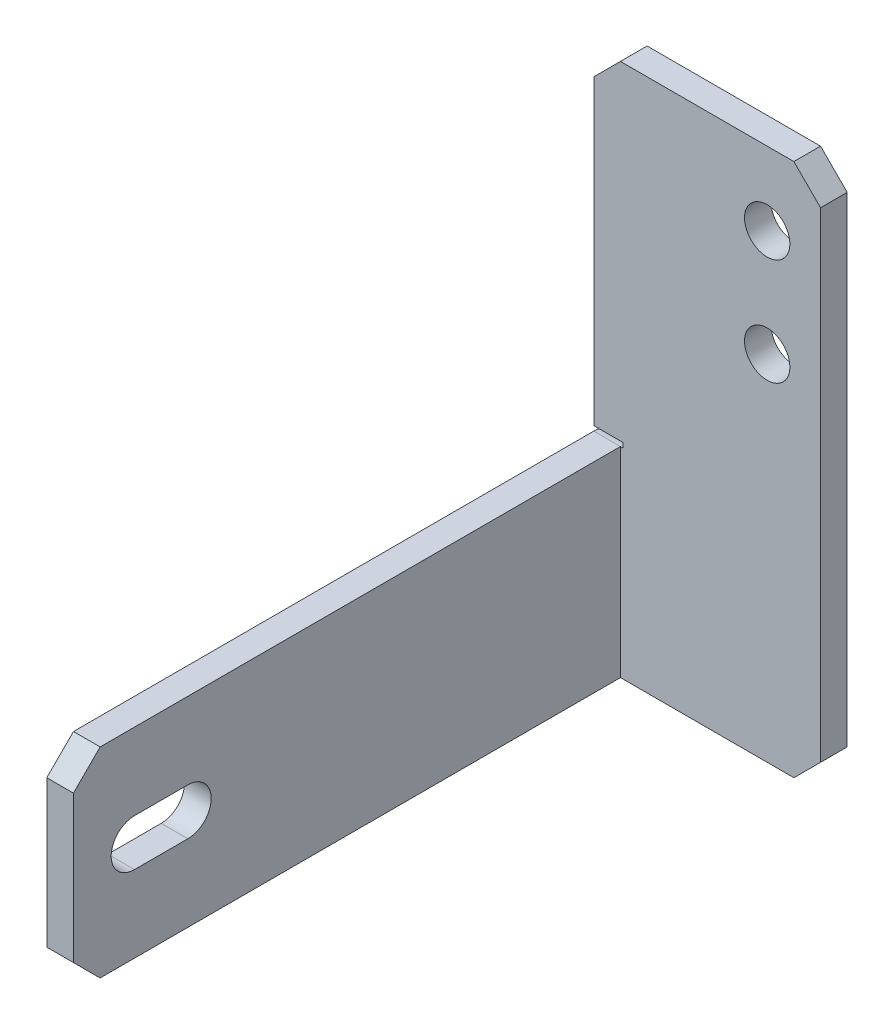
ISO-10303-21;
HEADER;
FILE_DESCRIPTION(('STEP AP214'),'2;1');
FILE_NAME('part.step','',(''),(''),'','','');
FILE_SCHEMA(('AUTOMOTIVE_DESIGN { 1 0 10303 214 1 1 1 1 }'));
ENDSEC;
DATA;
#1=APPLICATION_CONTEXT('core data for automotive mechanical design processes');
#2=APPLICATION_PROTOCOL_DEFINITION('international standard','automotive_design',2000,#1);
#3=PRODUCT_CONTEXT('',#1,'mechanical');
#4=PRODUCT('Part','Part','',(#3));
#5=PRODUCT_RELATED_PRODUCT_CATEGORY('part','',(#4));
#6=PRODUCT_DEFINITION_FORMATION('','',#4);
#7=PRODUCT_DEFINITION_CONTEXT('part definition',#1,'design');
#8=PRODUCT_DEFINITION('design','',#6,#7);
#9=PRODUCT_DEFINITION_SHAPE('','',#8);
#10=(LENGTH_UNIT() NAMED_UNIT(*) SI_UNIT(.MILLI.,.METRE.));
#11=(NAMED_UNIT(*) PLANE_ANGLE_UNIT() SI_UNIT($,.RADIAN.));
#12=(NAMED_UNIT(*) SI_UNIT($,.STERADIAN.) SOLID_ANGLE_UNIT());
#13=UNCERTAINTY_MEASURE_WITH_UNIT(LENGTH_MEASURE(1.E-05),#10,'distance_accuracy_value','');
#14=(GEOMETRIC_REPRESENTATION_CONTEXT(3) GLOBAL_UNCERTAINTY_ASSIGNED_CONTEXT((#13)) GLOBAL_UNIT_ASSIGNED_CONTEXT((#10,
#11,#12)) REPRESENTATION_CONTEXT('',''));
#15=CARTESIAN_POINT('',(0.,0.,0.));
#16=DIRECTION('',(0.,0.,1.));
#17=DIRECTION('',(1.,0.,0.));
#18=AXIS2_PLACEMENT_3D('',#15,#16,#17);
#19=CARTESIAN_POINT('',(0.,0.,2.));
#20=DIRECTION('',(0.,0.,1.));
#21=DIRECTION('',(1.,0.,0.));
#22=AXIS2_PLACEMENT_3D('',#19,#20,#21);
#23=PLANE('',#22);
#24=DIRECTION('',(1.,0.,0.));
#25=VECTOR('',#24,1.);
#26=CARTESIAN_POINT('',(-8.0785123966942,-24.7210743801653,2.));
#27=LINE('',#26,#25);
#28=CARTESIAN_POINT('',(-6.07851239669421,-24.7210743801653,2.));
#29=VERTEX_POINT('',#28);
#30=CARTESIAN_POINT('',(6.9214876033058,-24.7210743801653,2.));
#31=VERTEX_POINT('',#30);
#32=EDGE_CURVE('E247',#29,#31,#27,.T.);
#33=ORIENTED_EDGE('',*,*,#32,.T.);
#34=DIRECTION('',(-0.707106781186549,-0.707106781186546,0.));
#35=VECTOR('',#34,1.);
#36=CARTESIAN_POINT('',(15.8212809917355,-15.8212809917356,2.));
#37=LINE('',#36,#35);
#38=CARTESIAN_POINT('',(8.9214876033058,-22.7210743801653,2.));
#39=VERTEX_POINT('',#38);
#40=EDGE_CURVE('E324',#31,#39,#37,.F.);
#41=ORIENTED_EDGE('',*,*,#40,.T.);
#42=DIRECTION('',(0.,1.,0.));
#43=VECTOR('',#42,1.);
#44=CARTESIAN_POINT('',(8.9214876033058,15.2789256198347,2.));
#45=LINE('',#44,#43);
#46=CARTESIAN_POINT('',(8.9214876033058,13.2789256198347,2.));
#47=VERTEX_POINT('',#46);
#48=EDGE_CURVE('E250',#39,#47,#45,.T.);
#49=ORIENTED_EDGE('',*,*,#48,.T.);
#50=DIRECTION('',(0.707106781186546,-0.707106781186549,0.));
#51=VECTOR('',#50,1.);
#52=CARTESIAN_POINT('',(11.1002066115703,11.1002066115702,2.));
#53=LINE('',#52,#51);
#54=CARTESIAN_POINT('',(6.9214876033058,15.2789256198347,2.));
#55=VERTEX_POINT('',#54);
#56=EDGE_CURVE('E321',#47,#55,#53,.F.);
#57=ORIENTED_EDGE('',*,*,#56,.T.);
#58=DIRECTION('',(-1.,0.,0.));
#59=VECTOR('',#58,1.);
#60=CARTESIAN_POINT('',(-8.07851239669421,15.2789256198347,2.));
#61=LINE('',#60,#59);
#62=CARTESIAN_POINT('',(-6.0785123966942,15.2789256198347,2.));
#63=VERTEX_POINT('',#62);
#64=EDGE_CURVE('E253',#55,#63,#61,.T.);
#65=ORIENTED_EDGE('',*,*,#64,.T.);
#66=DIRECTION('',(0.707106781186549,0.707106781186546,0.));
#67=VECTOR('',#66,1.);
#68=CARTESIAN_POINT('',(-10.6787190082644,10.6787190082645,2.));
#69=LINE('',#68,#67);
#70=CARTESIAN_POINT('',(-8.07851239669421,13.2789256198347,2.));
#71=VERTEX_POINT('',#70);
#72=EDGE_CURVE('E48',#63,#71,#69,.F.);
#73=ORIENTED_EDGE('',*,*,#72,.T.);
#74=DIRECTION('',(0.,-1.,0.));
#75=VECTOR('',#74,1.);
#76=CARTESIAN_POINT('',(-8.07851239669421,15.2789256198347,2.));
#77=LINE('',#76,#75);
#78=CARTESIAN_POINT('',(-8.0785123966942,-9.3618955400596,2.));
#79=VERTEX_POINT('',#78);
#80=EDGE_CURVE('E236',#71,#79,#77,.T.);
#81=ORIENTED_EDGE('',*,*,#80,.T.);
#82=DIRECTION('',(1.,0.,0.));
#83=VECTOR('',#82,1.);
#84=CARTESIAN_POINT('',(-8.0785123966942,-9.3618955400596,2.));
#85=LINE('',#84,#83);
#86=CARTESIAN_POINT('',(-5.8785123966942,-9.3618955400596,2.));
#87=VERTEX_POINT('',#86);
#88=EDGE_CURVE('E238',#79,#87,#85,.T.);
#89=ORIENTED_EDGE('',*,*,#88,.T.);
#90=DIRECTION('',(0.,-1.,0.));
#91=VECTOR('',#90,1.);
#92=CARTESIAN_POINT('',(-5.8785123966942,-9.3618955400596,2.));
#93=LINE('',#92,#91);
#94=CARTESIAN_POINT('',(-5.8785123966942,-9.72107438016529,2.));
#95=VERTEX_POINT('',#94);
#96=EDGE_CURVE('E241',#87,#95,#93,.T.);
#97=ORIENTED_EDGE('',*,*,#96,.T.);
#98=DIRECTION('',(-1.,0.,0.));
#99=VECTOR('',#98,1.);
#100=CARTESIAN_POINT('',(-8.0785123966942,-9.72107438016529,2.));
#101=LINE('',#100,#99);
#102=CARTESIAN_POINT('',(-6.07851239669421,-9.72107438016529,2.));
#103=VERTEX_POINT('',#102);
#104=EDGE_CURVE('E244',#95,#103,#101,.T.);
#105=ORIENTED_EDGE('',*,*,#104,.T.);
#106=DIRECTION('',(0.,1.,0.));
#107=VECTOR('',#106,1.);
#108=CARTESIAN_POINT('',(-6.07851239669421,-9.72107438016529,2.));
#109=LINE('',#108,#107);
#110=EDGE_CURVE('E207',#29,#103,#109,.T.);
#111=ORIENTED_EDGE('',*,*,#110,.F.);
#112=EDGE_LOOP('',(#33,#41,#49,#57,#65,#73,#81,#89,#97,#105,#111));
#113=FACE_BOUND('',#112,.T.);
#114=CARTESIAN_POINT('',(4.9214876033058,9.77892561983471,2.));
#115=DIRECTION('',(0.,0.,1.));
#116=DIRECTION('',(1.,0.,0.));
#117=AXIS2_PLACEMENT_3D('',#114,#115,#116);
#118=CIRCLE('',#117,1.7);
#119=CARTESIAN_POINT('',(6.6214876033058,9.77892561983471,2.));
#120=VERTEX_POINT('',#119);
#121=EDGE_CURVE('E230',#120,#120,#118,.T.);
#122=ORIENTED_EDGE('',*,*,#121,.F.);
#123=EDGE_LOOP('',(#122));
#124=FACE_BOUND('',#123,.T.);
#125=CARTESIAN_POINT('',(4.9214876033058,1.77892561983471,2.));
#126=DIRECTION('',(0.,0.,1.));
#127=DIRECTION('',(1.,0.,0.));
#128=AXIS2_PLACEMENT_3D('',#125,#126,#127);
#129=CIRCLE('',#128,1.7);
#130=CARTESIAN_POINT('',(6.6214876033058,1.77892561983471,2.));
#131=VERTEX_POINT('',#130);
#132=EDGE_CURVE('E224',#131,#131,#129,.T.);
#133=ORIENTED_EDGE('',*,*,#132,.F.);
#134=EDGE_LOOP('',(#133));
#135=FACE_BOUND('',#134,.T.);
#136=ADVANCED_FACE('F33',(#113,#124,#135),#23,.T.);
#137=CARTESIAN_POINT('',(0.,0.,0.));
#138=DIRECTION('',(0.,0.,1.));
#139=DIRECTION('',(1.,0.,0.));
#140=AXIS2_PLACEMENT_3D('',#137,#138,#139);
#141=PLANE('',#140);
#142=DIRECTION('',(0.,1.,0.));
#143=VECTOR('',#142,1.);
#144=CARTESIAN_POINT('',(8.9214876033058,15.2789256198347,0.));
#145=LINE('',#144,#143);
#146=CARTESIAN_POINT('',(8.9214876033058,-22.7210743801653,0.));
#147=VERTEX_POINT('',#146);
#148=CARTESIAN_POINT('',(8.9214876033058,13.2789256198347,0.));
#149=VERTEX_POINT('',#148);
#150=EDGE_CURVE('E267',#147,#149,#145,.T.);
#151=ORIENTED_EDGE('',*,*,#150,.F.);
#152=DIRECTION('',(0.707106781186549,0.707106781186546,0.));
#153=VECTOR('',#152,1.);
#154=CARTESIAN_POINT('',(8.9214876033058,-22.7210743801653,0.));
#155=LINE('',#154,#153);
#156=CARTESIAN_POINT('',(6.9214876033058,-24.7210743801653,0.));
#157=VERTEX_POINT('',#156);
#158=EDGE_CURVE('E319',#147,#157,#155,.F.);
#159=ORIENTED_EDGE('',*,*,#158,.T.);
#160=DIRECTION('',(1.,0.,0.));
#161=VECTOR('',#160,1.);
#162=CARTESIAN_POINT('',(-8.0785123966942,-24.7210743801653,0.));
#163=LINE('',#162,#161);
#164=CARTESIAN_POINT('',(-8.0785123966942,-24.7210743801653,0.));
#165=VERTEX_POINT('',#164);
#166=EDGE_CURVE('E264',#165,#157,#163,.T.);
#167=ORIENTED_EDGE('',*,*,#166,.F.);
#168=DIRECTION('',(0.,-1.,0.));
#169=VECTOR('',#168,1.);
#170=CARTESIAN_POINT('',(-8.0785123966942,-9.72107438016529,0.));
#171=LINE('',#170,#169);
#172=CARTESIAN_POINT('',(-8.0785123966942,-11.7210743801653,0.));
#173=VERTEX_POINT('',#172);
#174=EDGE_CURVE('E261',#173,#165,#171,.T.);
#175=ORIENTED_EDGE('',*,*,#174,.F.);
#176=DIRECTION('',(-1.,0.,0.));
#177=VECTOR('',#176,1.);
#178=CARTESIAN_POINT('',(0.,-11.7210743801653,0.));
#179=LINE('',#178,#177);
#180=CARTESIAN_POINT('',(-5.8785123966942,-11.7210743801653,0.));
#181=VERTEX_POINT('',#180);
#182=EDGE_CURVE('E285',#173,#181,#179,.F.);
#183=ORIENTED_EDGE('',*,*,#182,.T.);
#184=DIRECTION('',(0.,-1.,0.));
#185=VECTOR('',#184,1.);
#186=CARTESIAN_POINT('',(-5.8785123966942,-9.3618955400596,0.));
#187=LINE('',#186,#185);
#188=CARTESIAN_POINT('',(-5.8785123966942,-9.3618955400596,0.));
#189=VERTEX_POINT('',#188);
#190=EDGE_CURVE('E259',#189,#181,#187,.T.);
#191=ORIENTED_EDGE('',*,*,#190,.F.);
#192=DIRECTION('',(1.,0.,0.));
#193=VECTOR('',#192,1.);
#194=CARTESIAN_POINT('',(-8.0785123966942,-9.3618955400596,0.));
#195=LINE('',#194,#193);
#196=CARTESIAN_POINT('',(-8.0785123966942,-9.3618955400596,0.));
#197=VERTEX_POINT('',#196);
#198=EDGE_CURVE('E257',#197,#189,#195,.T.);
#199=ORIENTED_EDGE('',*,*,#198,.F.);
#200=DIRECTION('',(0.,-1.,0.));
#201=VECTOR('',#200,1.);
#202=CARTESIAN_POINT('',(-8.07851239669421,15.2789256198347,0.));
#203=LINE('',#202,#201);
#204=CARTESIAN_POINT('',(-8.07851239669421,13.2789256198347,0.));
#205=VERTEX_POINT('',#204);
#206=EDGE_CURVE('E233',#205,#197,#203,.T.);
#207=ORIENTED_EDGE('',*,*,#206,.F.);
#208=DIRECTION('',(-0.707106781186549,-0.707106781186546,0.));
#209=VECTOR('',#208,1.);
#210=CARTESIAN_POINT('',(-8.07851239669421,13.2789256198347,0.));
#211=LINE('',#210,#209);
#212=CARTESIAN_POINT('',(-6.0785123966942,15.2789256198347,0.));
#213=VERTEX_POINT('',#212);
#214=EDGE_CURVE('E317',#205,#213,#211,.F.);
#215=ORIENTED_EDGE('',*,*,#214,.T.);
#216=DIRECTION('',(-1.,0.,0.));
#217=VECTOR('',#216,1.);
#218=CARTESIAN_POINT('',(-8.07851239669421,15.2789256198347,0.));
#219=LINE('',#218,#217);
#220=CARTESIAN_POINT('',(6.9214876033058,15.2789256198347,0.));
#221=VERTEX_POINT('',#220);
#222=EDGE_CURVE('E239',#221,#213,#219,.T.);
#223=ORIENTED_EDGE('',*,*,#222,.F.);
#224=DIRECTION('',(-0.707106781186546,0.707106781186549,0.));
#225=VECTOR('',#224,1.);
#226=CARTESIAN_POINT('',(6.9214876033058,15.2789256198347,0.));
#227=LINE('',#226,#225);
#228=EDGE_CURVE('E315',#221,#149,#227,.F.);
#229=ORIENTED_EDGE('',*,*,#228,.T.);
#230=EDGE_LOOP('',(#151,#159,#167,#175,#183,#191,#199,#207,#215,#223,#229));
#231=FACE_BOUND('',#230,.T.);
#232=CARTESIAN_POINT('',(4.9214876033058,9.77892561983471,0.));
#233=DIRECTION('',(0.,0.,1.));
#234=DIRECTION('',(1.,0.,0.));
#235=AXIS2_PLACEMENT_3D('',#232,#233,#234);
#236=CIRCLE('',#235,1.7);
#237=CARTESIAN_POINT('',(6.6214876033058,9.77892561983471,0.));
#238=VERTEX_POINT('',#237);
#239=EDGE_CURVE('E227',#238,#238,#236,.T.);
#240=ORIENTED_EDGE('',*,*,#239,.T.);
#241=EDGE_LOOP('',(#240));
#242=FACE_BOUND('',#241,.T.);
#243=CARTESIAN_POINT('',(4.9214876033058,1.77892561983471,0.));
#244=DIRECTION('',(0.,0.,1.));
#245=DIRECTION('',(1.,0.,0.));
#246=AXIS2_PLACEMENT_3D('',#243,#244,#245);
#247=CIRCLE('',#246,1.7);
#248=CARTESIAN_POINT('',(6.6214876033058,1.77892561983471,0.));
#249=VERTEX_POINT('',#248);
#250=EDGE_CURVE('E223',#249,#249,#247,.T.);
#251=ORIENTED_EDGE('',*,*,#250,.T.);
#252=EDGE_LOOP('',(#251));
#253=FACE_BOUND('',#252,.T.);
#254=ADVANCED_FACE('F336',(#231,#242,#253),#141,.F.);
#255=CARTESIAN_POINT('',(-8.07851239669421,15.2789256198347,2.));
#256=DIRECTION('',(1.,0.,0.));
#257=DIRECTION('',(0.,1.,0.));
#258=AXIS2_PLACEMENT_3D('',#255,#256,#257);
#259=PLANE('',#258);
#260=ORIENTED_EDGE('',*,*,#80,.F.);
#261=DIRECTION('',(0.,0.,-1.));
#262=VECTOR('',#261,1.);
#263=CARTESIAN_POINT('',(-8.07851239669421,13.2789256198347,2.));
#264=LINE('',#263,#262);
#265=EDGE_CURVE('E326',#71,#205,#264,.T.);
#266=ORIENTED_EDGE('',*,*,#265,.T.);
#267=ORIENTED_EDGE('',*,*,#206,.T.);
#268=DIRECTION('',(0.,0.,-1.));
#269=VECTOR('',#268,1.);
#270=CARTESIAN_POINT('',(-8.0785123966942,-9.3618955400596,2.));
#271=LINE('',#270,#269);
#272=EDGE_CURVE('E277',#79,#197,#271,.T.);
#273=ORIENTED_EDGE('',*,*,#272,.F.);
#274=EDGE_LOOP('',(#260,#266,#267,#273));
#275=FACE_BOUND('',#274,.T.);
#276=ADVANCED_FACE('F344',(#275),#259,.F.);
#277=CARTESIAN_POINT('',(-8.0785123966942,-9.3618955400596,2.));
#278=DIRECTION('',(0.,1.,0.));
#279=DIRECTION('',(0.,0.,1.));
#280=AXIS2_PLACEMENT_3D('',#277,#278,#279);
#281=PLANE('',#280);
#282=ORIENTED_EDGE('',*,*,#198,.T.);
#283=DIRECTION('',(0.,0.,-1.));
#284=VECTOR('',#283,1.);
#285=CARTESIAN_POINT('',(-5.8785123966942,-9.3618955400596,2.));
#286=LINE('',#285,#284);
#287=EDGE_CURVE('E274',#87,#189,#286,.T.);
#288=ORIENTED_EDGE('',*,*,#287,.F.);
#289=ORIENTED_EDGE('',*,*,#88,.F.);
#290=ORIENTED_EDGE('',*,*,#272,.T.);
#291=EDGE_LOOP('',(#282,#288,#289,#290));
#292=FACE_BOUND('',#291,.T.);
#293=ADVANCED_FACE('F350',(#292),#281,.F.);
#294=CARTESIAN_POINT('',(-5.8785123966942,-9.3618955400596,2.));
#295=DIRECTION('',(1.,0.,0.));
#296=DIRECTION('',(0.,0.,-1.));
#297=AXIS2_PLACEMENT_3D('',#294,#295,#296);
#298=PLANE('',#297);
#299=ORIENTED_EDGE('',*,*,#190,.T.);
#300=CARTESIAN_POINT('',(-5.8785123966942,-11.7210743801653,2.));
#301=DIRECTION('',(1.,0.,0.));
#302=DIRECTION('',(0.,0.,-1.));
#303=AXIS2_PLACEMENT_3D('',#300,#301,#302);
#304=CIRCLE('',#303,2.);
#305=EDGE_CURVE('E288',#181,#95,#304,.T.);
#306=ORIENTED_EDGE('',*,*,#305,.T.);
#307=ORIENTED_EDGE('',*,*,#96,.F.);
#308=ORIENTED_EDGE('',*,*,#287,.T.);
#309=EDGE_LOOP('',(#299,#306,#307,#308));
#310=FACE_BOUND('',#309,.T.);
#311=ADVANCED_FACE('F354',(#310),#298,.F.);
#312=CARTESIAN_POINT('',(-8.0785123966942,-9.72107438016529,2.));
#313=DIRECTION('',(0.,-1.,0.));
#314=DIRECTION('',(0.,0.,-1.));
#315=AXIS2_PLACEMENT_3D('',#312,#313,#314);
#316=PLANE('',#315);
#317=DIRECTION('',(0.,0.,-1.));
#318=VECTOR('',#317,1.);
#319=CARTESIAN_POINT('',(-8.0785123966942,-9.72107438016529,2.));
#320=LINE('',#319,#318);
#321=CARTESIAN_POINT('',(-8.0785123966942,-9.72107438016529,41.));
#322=VERTEX_POINT('',#321);
#323=CARTESIAN_POINT('',(-8.0785123966942,-9.72107438016529,2.));
#324=VERTEX_POINT('',#323);
#325=EDGE_CURVE('E272',#322,#324,#320,.T.);
#326=ORIENTED_EDGE('',*,*,#325,.F.);
#327=DIRECTION('',(1.,0.,0.));
#328=VECTOR('',#327,1.);
#329=CARTESIAN_POINT('',(-6.07851239669421,-9.72107438016529,41.));
#330=LINE('',#329,#328);
#331=CARTESIAN_POINT('',(-6.07851239669421,-9.72107438016529,41.));
#332=VERTEX_POINT('',#331);
#333=EDGE_CURVE('E300',#322,#332,#330,.T.);
#334=ORIENTED_EDGE('',*,*,#333,.T.);
#335=DIRECTION('',(0.,0.,-1.));
#336=VECTOR('',#335,1.);
#337=CARTESIAN_POINT('',(-6.07851239669421,-9.72107438016529,43.));
#338=LINE('',#337,#336);
#339=EDGE_CURVE('E217',#332,#103,#338,.T.);
#340=ORIENTED_EDGE('',*,*,#339,.T.);
#341=DIRECTION('',(-1.,0.,0.));
#342=VECTOR('',#341,1.);
#343=CARTESIAN_POINT('',(-8.0785123966942,-9.72107438016529,2.));
#344=LINE('',#343,#342);
#345=EDGE_CURVE('E280',#103,#324,#344,.T.);
#346=ORIENTED_EDGE('',*,*,#345,.T.);
#347=EDGE_LOOP('',(#326,#334,#340,#346));
#348=FACE_BOUND('',#347,.T.);
#349=ADVANCED_FACE('F365',(#348),#316,.F.);
#350=CARTESIAN_POINT('',(-8.0785123966942,-9.72107438016529,2.));
#351=DIRECTION('',(1.,0.,0.));
#352=DIRECTION('',(0.,1.,0.));
#353=AXIS2_PLACEMENT_3D('',#350,#351,#352);
#354=PLANE('',#353);
#355=DIRECTION('',(0.,0.,1.));
#356=VECTOR('',#355,1.);
#357=CARTESIAN_POINT('',(-8.07851239669421,-15.4710743801653,38.4237287514111));
#358=LINE('',#357,#356);
#359=CARTESIAN_POINT('',(-8.07851239669421,-15.4710743801653,34.4237287514111));
#360=VERTEX_POINT('',#359);
#361=CARTESIAN_POINT('',(-8.07851239669421,-15.4710743801653,38.4237287514111));
#362=VERTEX_POINT('',#361);
#363=EDGE_CURVE('E179',#360,#362,#358,.T.);
#364=ORIENTED_EDGE('',*,*,#363,.T.);
#365=CARTESIAN_POINT('',(-8.07851239669421,-17.2210743801653,38.4237287514111));
#366=DIRECTION('',(1.,0.,0.));
#367=DIRECTION('',(0.,1.,0.));
#368=AXIS2_PLACEMENT_3D('',#365,#366,#367);
#369=CIRCLE('',#368,1.75);
#370=CARTESIAN_POINT('',(-8.07851239669421,-18.9710743801653,38.4237287514111));
#371=VERTEX_POINT('',#370);
#372=EDGE_CURVE('E171',#362,#371,#369,.T.);
#373=ORIENTED_EDGE('',*,*,#372,.T.);
#374=DIRECTION('',(0.,0.,-1.));
#375=VECTOR('',#374,1.);
#376=CARTESIAN_POINT('',(-8.07851239669421,-18.9710743801653,38.4237287514111));
#377=LINE('',#376,#375);
#378=CARTESIAN_POINT('',(-8.0785123966942,-18.9710743801653,34.4237287514111));
#379=VERTEX_POINT('',#378);
#380=EDGE_CURVE('E183',#371,#379,#377,.T.);
#381=ORIENTED_EDGE('',*,*,#380,.T.);
#382=CARTESIAN_POINT('',(-8.07851239669421,-17.2210743801653,34.4237287514111));
#383=DIRECTION('',(1.,0.,0.));
#384=DIRECTION('',(0.,1.,0.));
#385=AXIS2_PLACEMENT_3D('',#382,#383,#384);
#386=CIRCLE('',#385,1.75);
#387=EDGE_CURVE('E187',#379,#360,#386,.T.);
#388=ORIENTED_EDGE('',*,*,#387,.T.);
#389=EDGE_LOOP('',(#364,#373,#381,#388));
#390=FACE_BOUND('',#389,.T.);
#391=DIRECTION('',(0.,-1.,0.));
#392=VECTOR('',#391,1.);
#393=CARTESIAN_POINT('',(-8.07851239669421,-9.72107438016529,43.));
#394=LINE('',#393,#392);
#395=CARTESIAN_POINT('',(-8.07851239669421,-11.7210743801653,43.));
#396=VERTEX_POINT('',#395);
#397=CARTESIAN_POINT('',(-8.0785123966942,-22.7210743801653,43.));
#398=VERTEX_POINT('',#397);
#399=EDGE_CURVE('E211',#396,#398,#394,.T.);
#400=ORIENTED_EDGE('',*,*,#399,.F.);
#401=DIRECTION('',(0.,0.707106781186546,-0.707106781186549));
#402=VECTOR('',#401,1.);
#403=CARTESIAN_POINT('',(-8.0785123966942,-11.7210743801653,43.));
#404=LINE('',#403,#402);
#405=EDGE_CURVE('E298',#396,#322,#404,.T.);
#406=ORIENTED_EDGE('',*,*,#405,.T.);
#407=ORIENTED_EDGE('',*,*,#325,.T.);
#408=CARTESIAN_POINT('',(-8.0785123966942,-11.7210743801653,2.));
#409=DIRECTION('',(1.,0.,0.));
#410=DIRECTION('',(0.,1.,0.));
#411=AXIS2_PLACEMENT_3D('',#408,#409,#410);
#412=CIRCLE('',#411,2.);
#413=EDGE_CURVE('E283',#324,#173,#412,.F.);
#414=ORIENTED_EDGE('',*,*,#413,.T.);
#415=ORIENTED_EDGE('',*,*,#174,.T.);
#416=DIRECTION('',(0.,0.,-1.));
#417=VECTOR('',#416,1.);
#418=CARTESIAN_POINT('',(-8.0785123966942,-24.7210743801653,2.));
#419=LINE('',#418,#417);
#420=CARTESIAN_POINT('',(-8.0785123966942,-24.7210743801653,41.));
#421=VERTEX_POINT('',#420);
#422=EDGE_CURVE('E255',#421,#165,#419,.T.);
#423=ORIENTED_EDGE('',*,*,#422,.F.);
#424=DIRECTION('',(0.,0.707106781186546,0.707106781186549));
#425=VECTOR('',#424,1.);
#426=CARTESIAN_POINT('',(-8.0785123966942,-22.7210743801653,43.));
#427=LINE('',#426,#425);
#428=EDGE_CURVE('E296',#421,#398,#427,.T.);
#429=ORIENTED_EDGE('',*,*,#428,.T.);
#430=EDGE_LOOP('',(#400,#406,#407,#414,#415,#423,#429));
#431=FACE_BOUND('',#430,.T.);
#432=ADVANCED_FACE('F189',(#390,#431),#354,.F.);
#433=CARTESIAN_POINT('',(-8.0785123966942,-24.7210743801653,2.));
#434=DIRECTION('',(0.,1.,0.));
#435=DIRECTION('',(0.,0.,1.));
#436=AXIS2_PLACEMENT_3D('',#433,#434,#435);
#437=PLANE('',#436);
#438=DIRECTION('',(0.,0.,-1.));
#439=VECTOR('',#438,1.);
#440=CARTESIAN_POINT('',(-6.0785123966942,-24.7210743801653,43.));
#441=LINE('',#440,#439);
#442=CARTESIAN_POINT('',(-6.0785123966942,-24.7210743801653,41.));
#443=VERTEX_POINT('',#442);
#444=EDGE_CURVE('E221',#443,#29,#441,.T.);
#445=ORIENTED_EDGE('',*,*,#444,.F.);
#446=DIRECTION('',(-1.,0.,0.));
#447=VECTOR('',#446,1.);
#448=CARTESIAN_POINT('',(-8.0785123966942,-24.7210743801653,41.));
#449=LINE('',#448,#447);
#450=EDGE_CURVE('E308',#443,#421,#449,.T.);
#451=ORIENTED_EDGE('',*,*,#450,.T.);
#452=ORIENTED_EDGE('',*,*,#422,.T.);
#453=ORIENTED_EDGE('',*,*,#166,.T.);
#454=DIRECTION('',(0.,0.,1.));
#455=VECTOR('',#454,1.);
#456=CARTESIAN_POINT('',(6.9214876033058,-24.7210743801653,2.));
#457=LINE('',#456,#455);
#458=EDGE_CURVE('E306',#157,#31,#457,.T.);
#459=ORIENTED_EDGE('',*,*,#458,.T.);
#460=ORIENTED_EDGE('',*,*,#32,.F.);
#461=EDGE_LOOP('',(#445,#451,#452,#453,#459,#460));
#462=FACE_BOUND('',#461,.T.);
#463=ADVANCED_FACE('F387',(#462),#437,.F.);
#464=CARTESIAN_POINT('',(8.9214876033058,15.2789256198347,2.));
#465=DIRECTION('',(-1.,0.,0.));
#466=DIRECTION('',(0.,-1.,0.));
#467=AXIS2_PLACEMENT_3D('',#464,#465,#466);
#468=PLANE('',#467);
#469=ORIENTED_EDGE('',*,*,#48,.F.);
#470=DIRECTION('',(0.,0.,-1.));
#471=VECTOR('',#470,1.);
#472=CARTESIAN_POINT('',(8.9214876033058,-22.7210743801653,2.));
#473=LINE('',#472,#471);
#474=EDGE_CURVE('E312',#39,#147,#473,.T.);
#475=ORIENTED_EDGE('',*,*,#474,.T.);
#476=ORIENTED_EDGE('',*,*,#150,.T.);
#477=DIRECTION('',(0.,0.,1.));
#478=VECTOR('',#477,1.);
#479=CARTESIAN_POINT('',(8.9214876033058,13.2789256198347,2.));
#480=LINE('',#479,#478);
#481=EDGE_CURVE('E310',#149,#47,#480,.T.);
#482=ORIENTED_EDGE('',*,*,#481,.T.);
#483=EDGE_LOOP('',(#469,#475,#476,#482));
#484=FACE_BOUND('',#483,.T.);
#485=ADVANCED_FACE('F395',(#484),#468,.F.);
#486=CARTESIAN_POINT('',(-8.07851239669421,15.2789256198347,2.));
#487=DIRECTION('',(0.,-1.,0.));
#488=DIRECTION('',(0.,0.,-1.));
#489=AXIS2_PLACEMENT_3D('',#486,#487,#488);
#490=PLANE('',#489);
#491=ORIENTED_EDGE('',*,*,#222,.T.);
#492=DIRECTION('',(0.,0.,1.));
#493=VECTOR('',#492,1.);
#494=CARTESIAN_POINT('',(-6.0785123966942,15.2789256198347,2.));
#495=LINE('',#494,#493);
#496=EDGE_CURVE('E11',#213,#63,#495,.T.);
#497=ORIENTED_EDGE('',*,*,#496,.T.);
#498=ORIENTED_EDGE('',*,*,#64,.F.);
#499=DIRECTION('',(0.,0.,-1.));
#500=VECTOR('',#499,1.);
#501=CARTESIAN_POINT('',(6.9214876033058,15.2789256198347,2.));
#502=LINE('',#501,#500);
#503=EDGE_CURVE('E41',#55,#221,#502,.T.);
#504=ORIENTED_EDGE('',*,*,#503,.T.);
#505=EDGE_LOOP('',(#491,#497,#498,#504));
#506=FACE_BOUND('',#505,.T.);
#507=ADVANCED_FACE('F331',(#506),#490,.F.);
#508=CARTESIAN_POINT('',(4.9214876033058,9.77892561983471,2.));
#509=DIRECTION('',(0.,0.,-1.));
#510=DIRECTION('',(-1.,0.,0.));
#511=AXIS2_PLACEMENT_3D('',#508,#509,#510);
#512=CYLINDRICAL_SURFACE('',#511,1.7);
#513=ORIENTED_EDGE('',*,*,#121,.T.);
#514=EDGE_LOOP('',(#513));
#515=FACE_BOUND('',#514,.T.);
#516=ORIENTED_EDGE('',*,*,#239,.F.);
#517=EDGE_LOOP('',(#516));
#518=FACE_BOUND('',#517,.T.);
#519=ADVANCED_FACE('F410',(#515,#518),#512,.F.);
#520=CARTESIAN_POINT('',(4.9214876033058,1.77892561983471,2.));
#521=DIRECTION('',(0.,0.,-1.));
#522=DIRECTION('',(-1.,0.,0.));
#523=AXIS2_PLACEMENT_3D('',#520,#521,#522);
#524=CYLINDRICAL_SURFACE('',#523,1.7);
#525=ORIENTED_EDGE('',*,*,#132,.T.);
#526=EDGE_LOOP('',(#525));
#527=FACE_BOUND('',#526,.T.);
#528=ORIENTED_EDGE('',*,*,#250,.F.);
#529=EDGE_LOOP('',(#528));
#530=FACE_BOUND('',#529,.T.);
#531=ADVANCED_FACE('F515',(#527,#530),#524,.F.);
#532=CARTESIAN_POINT('',(-6.07851239669421,-9.72107438016529,43.));
#533=DIRECTION('',(-1.,0.,0.));
#534=DIRECTION('',(0.,-1.,0.));
#535=AXIS2_PLACEMENT_3D('',#532,#533,#534);
#536=PLANE('',#535);
#537=DIRECTION('',(0.,0.,-1.));
#538=VECTOR('',#537,1.);
#539=CARTESIAN_POINT('',(-6.0785123966942,-18.9710743801653,38.4237287514111));
#540=LINE('',#539,#538);
#541=CARTESIAN_POINT('',(-6.07851239669421,-18.9710743801653,38.4237287514111));
#542=VERTEX_POINT('',#541);
#543=CARTESIAN_POINT('',(-6.07851239669421,-18.9710743801653,34.4237287514111));
#544=VERTEX_POINT('',#543);
#545=EDGE_CURVE('E201',#542,#544,#540,.T.);
#546=ORIENTED_EDGE('',*,*,#545,.F.);
#547=CARTESIAN_POINT('',(-6.07851239669421,-17.2210743801653,38.4237287514111));
#548=DIRECTION('',(1.,0.,0.));
#549=DIRECTION('',(0.,1.,0.));
#550=AXIS2_PLACEMENT_3D('',#547,#548,#549);
#551=CIRCLE('',#550,1.75);
#552=CARTESIAN_POINT('',(-6.07851239669421,-15.4710743801653,38.4237287514111));
#553=VERTEX_POINT('',#552);
#554=EDGE_CURVE('E174',#553,#542,#551,.T.);
#555=ORIENTED_EDGE('',*,*,#554,.F.);
#556=DIRECTION('',(0.,0.,1.));
#557=VECTOR('',#556,1.);
#558=CARTESIAN_POINT('',(-6.07851239669421,-15.4710743801653,38.4237287514111));
#559=LINE('',#558,#557);
#560=CARTESIAN_POINT('',(-6.07851239669421,-15.4710743801653,34.4237287514111));
#561=VERTEX_POINT('',#560);
#562=EDGE_CURVE('E192',#561,#553,#559,.T.);
#563=ORIENTED_EDGE('',*,*,#562,.F.);
#564=CARTESIAN_POINT('',(-6.07851239669421,-17.2210743801653,34.4237287514111));
#565=DIRECTION('',(1.,0.,0.));
#566=DIRECTION('',(0.,1.,0.));
#567=AXIS2_PLACEMENT_3D('',#564,#565,#566);
#568=CIRCLE('',#567,1.75);
#569=EDGE_CURVE('E195',#544,#561,#568,.T.);
#570=ORIENTED_EDGE('',*,*,#569,.F.);
#571=EDGE_LOOP('',(#546,#555,#563,#570));
#572=FACE_BOUND('',#571,.T.);
#573=ORIENTED_EDGE('',*,*,#339,.F.);
#574=DIRECTION('',(0.,-0.707106781186546,0.707106781186549));
#575=VECTOR('',#574,1.);
#576=CARTESIAN_POINT('',(-6.07851239669421,-11.7210743801653,43.));
#577=LINE('',#576,#575);
#578=CARTESIAN_POINT('',(-6.07851239669421,-11.7210743801653,43.));
#579=VERTEX_POINT('',#578);
#580=EDGE_CURVE('E304',#332,#579,#577,.T.);
#581=ORIENTED_EDGE('',*,*,#580,.T.);
#582=DIRECTION('',(0.,1.,0.));
#583=VECTOR('',#582,1.);
#584=CARTESIAN_POINT('',(-6.07851239669421,-9.72107438016529,43.));
#585=LINE('',#584,#583);
#586=CARTESIAN_POINT('',(-6.0785123966942,-22.7210743801653,43.));
#587=VERTEX_POINT('',#586);
#588=EDGE_CURVE('E214',#587,#579,#585,.T.);
#589=ORIENTED_EDGE('',*,*,#588,.F.);
#590=DIRECTION('',(0.,-0.707106781186546,-0.707106781186549));
#591=VECTOR('',#590,1.);
#592=CARTESIAN_POINT('',(-6.0785123966942,-22.7210743801653,43.));
#593=LINE('',#592,#591);
#594=EDGE_CURVE('E302',#587,#443,#593,.T.);
#595=ORIENTED_EDGE('',*,*,#594,.T.);
#596=ORIENTED_EDGE('',*,*,#444,.T.);
#597=ORIENTED_EDGE('',*,*,#110,.T.);
#598=EDGE_LOOP('',(#573,#581,#589,#595,#596,#597));
#599=FACE_BOUND('',#598,.T.);
#600=ADVANCED_FACE('F370',(#572,#599),#536,.F.);
#601=CARTESIAN_POINT('',(0.,0.,43.));
#602=DIRECTION('',(0.,0.,1.));
#603=DIRECTION('',(1.,0.,0.));
#604=AXIS2_PLACEMENT_3D('',#601,#602,#603);
#605=PLANE('',#604);
#606=ORIENTED_EDGE('',*,*,#588,.T.);
#607=DIRECTION('',(-1.,0.,0.));
#608=VECTOR('',#607,1.);
#609=CARTESIAN_POINT('',(-8.07851239669421,-11.7210743801653,43.));
#610=LINE('',#609,#608);
#611=EDGE_CURVE('E293',#579,#396,#610,.T.);
#612=ORIENTED_EDGE('',*,*,#611,.T.);
#613=ORIENTED_EDGE('',*,*,#399,.T.);
#614=DIRECTION('',(1.,0.,0.));
#615=VECTOR('',#614,1.);
#616=CARTESIAN_POINT('',(-6.0785123966942,-22.7210743801653,43.));
#617=LINE('',#616,#615);
#618=EDGE_CURVE('E290',#398,#587,#617,.T.);
#619=ORIENTED_EDGE('',*,*,#618,.T.);
#620=EDGE_LOOP('',(#606,#612,#613,#619));
#621=FACE_BOUND('',#620,.T.);
#622=ADVANCED_FACE('F377',(#621),#605,.T.);
#623=CARTESIAN_POINT('',(-8.07851239669421,-17.2210743801653,38.4237287514111));
#624=DIRECTION('',(1.,0.,0.));
#625=DIRECTION('',(0.,1.,0.));
#626=AXIS2_PLACEMENT_3D('',#623,#624,#625);
#627=CYLINDRICAL_SURFACE('',#626,1.75);
#628=ORIENTED_EDGE('',*,*,#554,.T.);
#629=DIRECTION('',(1.,0.,0.));
#630=VECTOR('',#629,1.);
#631=CARTESIAN_POINT('',(-8.07851239669421,-18.9710743801653,38.4237287514111));
#632=LINE('',#631,#630);
#633=EDGE_CURVE('E167',#371,#542,#632,.T.);
#634=ORIENTED_EDGE('',*,*,#633,.F.);
#635=ORIENTED_EDGE('',*,*,#372,.F.);
#636=DIRECTION('',(1.,0.,0.));
#637=VECTOR('',#636,1.);
#638=CARTESIAN_POINT('',(-8.07851239669421,-15.4710743801653,38.4237287514111));
#639=LINE('',#638,#637);
#640=EDGE_CURVE('E205',#362,#553,#639,.T.);
#641=ORIENTED_EDGE('',*,*,#640,.T.);
#642=EDGE_LOOP('',(#628,#634,#635,#641));
#643=FACE_BOUND('',#642,.T.);
#644=ADVANCED_FACE('F169',(#643),#627,.F.);
#645=CARTESIAN_POINT('',(-8.07851239669421,-15.4710743801653,38.4237287514111));
#646=DIRECTION('',(0.,1.,0.));
#647=DIRECTION('',(-1.,0.,0.));
#648=AXIS2_PLACEMENT_3D('',#645,#646,#647);
#649=PLANE('',#648);
#650=ORIENTED_EDGE('',*,*,#562,.T.);
#651=ORIENTED_EDGE('',*,*,#640,.F.);
#652=ORIENTED_EDGE('',*,*,#363,.F.);
#653=DIRECTION('',(1.,0.,0.));
#654=VECTOR('',#653,1.);
#655=CARTESIAN_POINT('',(-8.07851239669421,-15.4710743801653,34.4237287514111));
#656=LINE('',#655,#654);
#657=EDGE_CURVE('E208',#360,#561,#656,.T.);
#658=ORIENTED_EDGE('',*,*,#657,.T.);
#659=EDGE_LOOP('',(#650,#651,#652,#658));
#660=FACE_BOUND('',#659,.T.);
#661=ADVANCED_FACE('F484',(#660),#649,.F.);
#662=CARTESIAN_POINT('',(-8.07851239669421,-17.2210743801653,34.4237287514111));
#663=DIRECTION('',(1.,0.,0.));
#664=DIRECTION('',(0.,1.,0.));
#665=AXIS2_PLACEMENT_3D('',#662,#663,#664);
#666=CYLINDRICAL_SURFACE('',#665,1.75);
#667=ORIENTED_EDGE('',*,*,#569,.T.);
#668=ORIENTED_EDGE('',*,*,#657,.F.);
#669=ORIENTED_EDGE('',*,*,#387,.F.);
#670=DIRECTION('',(1.,0.,0.));
#671=VECTOR('',#670,1.);
#672=CARTESIAN_POINT('',(-8.07851239669421,-18.9710743801653,34.4237287514111));
#673=LINE('',#672,#671);
#674=EDGE_CURVE('E178',#379,#544,#673,.T.);
#675=ORIENTED_EDGE('',*,*,#674,.T.);
#676=EDGE_LOOP('',(#667,#668,#669,#675));
#677=FACE_BOUND('',#676,.T.);
#678=ADVANCED_FACE('F476',(#677),#666,.F.);
#679=CARTESIAN_POINT('',(-8.07851239669421,-18.9710743801653,38.4237287514111));
#680=DIRECTION('',(0.,-1.,0.));
#681=DIRECTION('',(1.,0.,0.));
#682=AXIS2_PLACEMENT_3D('',#679,#680,#681);
#683=PLANE('',#682);
#684=ORIENTED_EDGE('',*,*,#545,.T.);
#685=ORIENTED_EDGE('',*,*,#674,.F.);
#686=ORIENTED_EDGE('',*,*,#380,.F.);
#687=ORIENTED_EDGE('',*,*,#633,.T.);
#688=EDGE_LOOP('',(#684,#685,#686,#687));
#689=FACE_BOUND('',#688,.T.);
#690=ADVANCED_FACE('F184',(#689),#683,.F.);
#691=CARTESIAN_POINT('',(-8.0785123966942,-11.7210743801653,2.));
#692=DIRECTION('',(-1.,0.,0.));
#693=DIRECTION('',(0.,0.,1.));
#694=AXIS2_PLACEMENT_3D('',#691,#692,#693);
#695=CYLINDRICAL_SURFACE('',#694,2.);
#696=ORIENTED_EDGE('',*,*,#305,.F.);
#697=ORIENTED_EDGE('',*,*,#182,.F.);
#698=ORIENTED_EDGE('',*,*,#413,.F.);
#699=ORIENTED_EDGE('',*,*,#345,.F.);
#700=ORIENTED_EDGE('',*,*,#104,.F.);
#701=EDGE_LOOP('',(#696,#697,#698,#699,#700));
#702=FACE_BOUND('',#701,.T.);
#703=ADVANCED_FACE('F360',(#702),#695,.T.);
#704=CARTESIAN_POINT('',(0.,-11.7210743801653,43.));
#705=DIRECTION('',(0.,0.707106781186549,0.707106781186546));
#706=DIRECTION('',(1.,0.,0.));
#707=AXIS2_PLACEMENT_3D('',#704,#705,#706);
#708=PLANE('',#707);
#709=ORIENTED_EDGE('',*,*,#580,.F.);
#710=ORIENTED_EDGE('',*,*,#333,.F.);
#711=ORIENTED_EDGE('',*,*,#405,.F.);
#712=ORIENTED_EDGE('',*,*,#611,.F.);
#713=EDGE_LOOP('',(#709,#710,#711,#712));
#714=FACE_BOUND('',#713,.T.);
#715=ADVANCED_FACE('F374',(#714),#708,.T.);
#716=CARTESIAN_POINT('',(0.,-22.7210743801653,43.));
#717=DIRECTION('',(0.,-0.707106781186549,0.707106781186546));
#718=DIRECTION('',(-1.,0.,0.));
#719=AXIS2_PLACEMENT_3D('',#716,#717,#718);
#720=PLANE('',#719);
#721=ORIENTED_EDGE('',*,*,#428,.F.);
#722=ORIENTED_EDGE('',*,*,#450,.F.);
#723=ORIENTED_EDGE('',*,*,#594,.F.);
#724=ORIENTED_EDGE('',*,*,#618,.F.);
#725=EDGE_LOOP('',(#721,#722,#723,#724));
#726=FACE_BOUND('',#725,.T.);
#727=ADVANCED_FACE('F383',(#726),#720,.T.);
#728=CARTESIAN_POINT('',(8.9214876033058,-22.7210743801653,2.));
#729=DIRECTION('',(-0.707106781186546,0.707106781186549,0.));
#730=DIRECTION('',(0.,0.,-1.));
#731=AXIS2_PLACEMENT_3D('',#728,#729,#730);
#732=PLANE('',#731);
#733=ORIENTED_EDGE('',*,*,#40,.F.);
#734=ORIENTED_EDGE('',*,*,#458,.F.);
#735=ORIENTED_EDGE('',*,*,#158,.F.);
#736=ORIENTED_EDGE('',*,*,#474,.F.);
#737=EDGE_LOOP('',(#733,#734,#735,#736));
#738=FACE_BOUND('',#737,.T.);
#739=ADVANCED_FACE('F393',(#738),#732,.F.);
#740=CARTESIAN_POINT('',(-8.07851239669421,13.2789256198347,2.));
#741=DIRECTION('',(0.707106781186546,-0.707106781186549,0.));
#742=DIRECTION('',(0.,0.,-1.));
#743=AXIS2_PLACEMENT_3D('',#740,#741,#742);
#744=PLANE('',#743);
#745=ORIENTED_EDGE('',*,*,#72,.F.);
#746=ORIENTED_EDGE('',*,*,#496,.F.);
#747=ORIENTED_EDGE('',*,*,#214,.F.);
#748=ORIENTED_EDGE('',*,*,#265,.F.);
#749=EDGE_LOOP('',(#745,#746,#747,#748));
#750=FACE_BOUND('',#749,.T.);
#751=ADVANCED_FACE('F342',(#750),#744,.F.);
#752=CARTESIAN_POINT('',(6.9214876033058,15.2789256198347,2.));
#753=DIRECTION('',(-0.707106781186549,-0.707106781186546,0.));
#754=DIRECTION('',(0.,0.,-1.));
#755=AXIS2_PLACEMENT_3D('',#752,#753,#754);
#756=PLANE('',#755);
#757=ORIENTED_EDGE('',*,*,#56,.F.);
#758=ORIENTED_EDGE('',*,*,#481,.F.);
#759=ORIENTED_EDGE('',*,*,#228,.F.);
#760=ORIENTED_EDGE('',*,*,#503,.F.);
#761=EDGE_LOOP('',(#757,#758,#759,#760));
#762=FACE_BOUND('',#761,.T.);
#763=ADVANCED_FACE('F35',(#762),#756,.F.);
#764=CLOSED_SHELL('',(#136,#254,#276,#293,#311,#349,#432,#463,#485,#507,#519,#531,#600,#622,
#644,#661,#678,#690,#703,#715,#727,#739,#751,#763));
#765=MANIFOLD_SOLID_BREP('B2',#764);
#766=ADVANCED_BREP_SHAPE_REPRESENTATION('',(#18,#765),#14);
#767=SHAPE_DEFINITION_REPRESENTATION(#9,#766);
ENDSEC;
END-ISO-10303-21;
